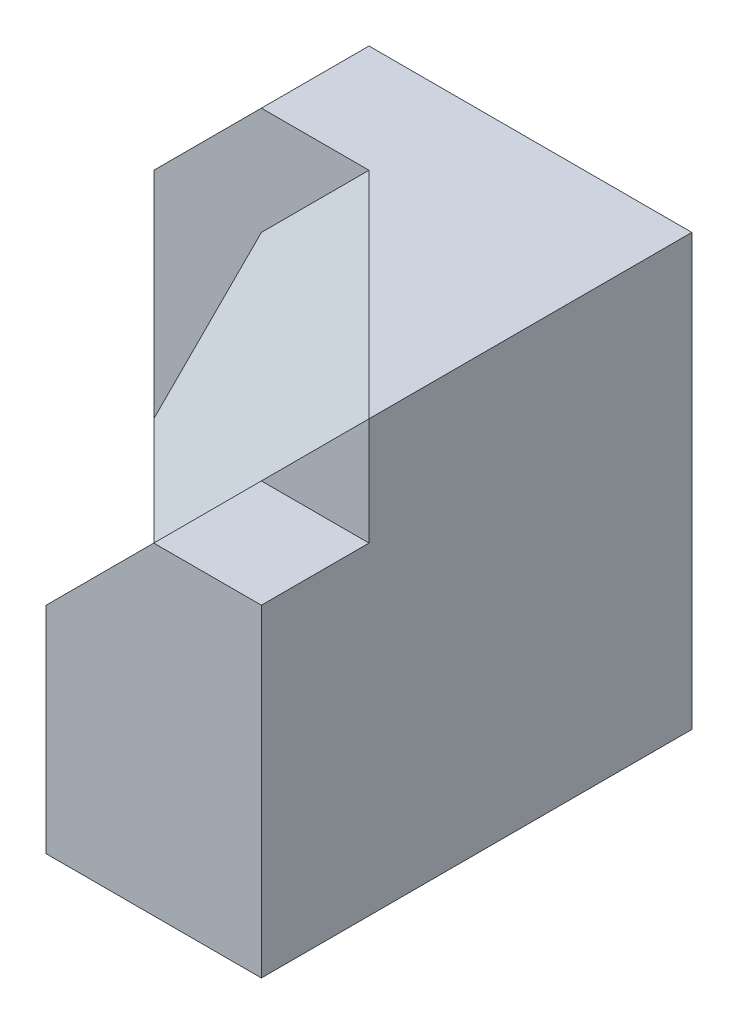
ISO-10303-21;
HEADER;
FILE_DESCRIPTION(('STEP AP214'),'2;1');
FILE_NAME('part.step','',(''),(''),'','','');
FILE_SCHEMA(('AUTOMOTIVE_DESIGN { 1 0 10303 214 1 1 1 1 }'));
ENDSEC;
DATA;
#1=APPLICATION_CONTEXT('core data for automotive mechanical design processes');
#2=APPLICATION_PROTOCOL_DEFINITION('international standard','automotive_design',2000,#1);
#3=PRODUCT_CONTEXT('',#1,'mechanical');
#4=PRODUCT('Part','Part','',(#3));
#5=PRODUCT_RELATED_PRODUCT_CATEGORY('part','',(#4));
#6=PRODUCT_DEFINITION_FORMATION('','',#4);
#7=PRODUCT_DEFINITION_CONTEXT('part definition',#1,'design');
#8=PRODUCT_DEFINITION('design','',#6,#7);
#9=PRODUCT_DEFINITION_SHAPE('','',#8);
#10=(LENGTH_UNIT() NAMED_UNIT(*) SI_UNIT(.MILLI.,.METRE.));
#11=(NAMED_UNIT(*) PLANE_ANGLE_UNIT() SI_UNIT($,.RADIAN.));
#12=(NAMED_UNIT(*) SI_UNIT($,.STERADIAN.) SOLID_ANGLE_UNIT());
#13=UNCERTAINTY_MEASURE_WITH_UNIT(LENGTH_MEASURE(1.E-05),#10,'distance_accuracy_value','');
#14=(GEOMETRIC_REPRESENTATION_CONTEXT(3) GLOBAL_UNCERTAINTY_ASSIGNED_CONTEXT((#13)) GLOBAL_UNIT_ASSIGNED_CONTEXT((#10,
#11,#12)) REPRESENTATION_CONTEXT('',''));
#15=CARTESIAN_POINT('',(0.,0.,0.));
#16=DIRECTION('',(0.,0.,1.));
#17=DIRECTION('',(1.,0.,0.));
#18=AXIS2_PLACEMENT_3D('',#15,#16,#17);
#19=CARTESIAN_POINT('',(-28.6563876651982,0.,-8.90969162995595));
#20=DIRECTION('',(0.707106781186547,0.,-0.707106781186548));
#21=DIRECTION('',(-0.707106781186548,0.,-0.707106781186547));
#22=AXIS2_PLACEMENT_3D('',#19,#20,#21);
#23=PLANE('',#22);
#24=DIRECTION('',(0.707106781186547,0.,0.707106781186548));
#25=VECTOR('',#24,1.);
#26=CARTESIAN_POINT('',(-18.6563876651982,10.,1.09030837004405));
#27=LINE('',#26,#25);
#28=CARTESIAN_POINT('',(-23.6563876651982,10.,-3.90969162995595));
#29=VERTEX_POINT('',#28);
#30=CARTESIAN_POINT('',(-18.6563876651982,10.,1.09030837004405));
#31=VERTEX_POINT('',#30);
#32=EDGE_CURVE('E58',#29,#31,#27,.T.);
#33=ORIENTED_EDGE('',*,*,#32,.F.);
#34=DIRECTION('',(0.,-1.,0.));
#35=VECTOR('',#34,1.);
#36=CARTESIAN_POINT('',(-23.6563876651982,20.,-3.90969162995595));
#37=LINE('',#36,#35);
#38=CARTESIAN_POINT('',(-23.6563876651982,5.,-3.90969162995595));
#39=VERTEX_POINT('',#38);
#40=EDGE_CURVE('E226',#29,#39,#37,.T.);
#41=ORIENTED_EDGE('',*,*,#40,.T.);
#42=DIRECTION('',(-0.707106781186548,0.,-0.707106781186547));
#43=VECTOR('',#42,1.);
#44=CARTESIAN_POINT('',(-28.6563876651982,5.,-8.90969162995595));
#45=LINE('',#44,#43);
#46=CARTESIAN_POINT('',(-28.6563876651982,5.,-8.90969162995595));
#47=VERTEX_POINT('',#46);
#48=EDGE_CURVE('E275',#39,#47,#45,.T.);
#49=ORIENTED_EDGE('',*,*,#48,.T.);
#50=DIRECTION('',(0.,1.,0.));
#51=VECTOR('',#50,1.);
#52=CARTESIAN_POINT('',(-28.6563876651982,0.,-8.90969162995595));
#53=LINE('',#52,#51);
#54=CARTESIAN_POINT('',(-28.6563876651982,0.,-8.90969162995595));
#55=VERTEX_POINT('',#54);
#56=EDGE_CURVE('E272',#55,#47,#53,.T.);
#57=ORIENTED_EDGE('',*,*,#56,.F.);
#58=DIRECTION('',(-0.707106781186548,0.,-0.707106781186547));
#59=VECTOR('',#58,1.);
#60=CARTESIAN_POINT('',(-28.6563876651982,0.,-8.90969162995595));
#61=LINE('',#60,#59);
#62=CARTESIAN_POINT('',(-18.6563876651982,0.,1.09030837004405));
#63=VERTEX_POINT('',#62);
#64=EDGE_CURVE('E235',#63,#55,#61,.T.);
#65=ORIENTED_EDGE('',*,*,#64,.F.);
#66=DIRECTION('',(0.,-1.,0.));
#67=VECTOR('',#66,1.);
#68=CARTESIAN_POINT('',(-18.6563876651982,20.,1.09030837004405));
#69=LINE('',#68,#67);
#70=EDGE_CURVE('E205',#31,#63,#69,.T.);
#71=ORIENTED_EDGE('',*,*,#70,.F.);
#72=EDGE_LOOP('',(#33,#41,#49,#57,#65,#71));
#73=FACE_BOUND('',#72,.T.);
#74=ADVANCED_FACE('F34',(#73),#23,.F.);
#75=CARTESIAN_POINT('',(-23.6563876651982,20.,-3.90969162995595));
#76=DIRECTION('',(-1.,0.,0.));
#77=DIRECTION('',(0.,0.,1.));
#78=AXIS2_PLACEMENT_3D('',#75,#76,#77);
#79=PLANE('',#78);
#80=ORIENTED_EDGE('',*,*,#40,.F.);
#81=DIRECTION('',(0.,-0.707106781186547,0.707106781186548));
#82=VECTOR('',#81,1.);
#83=CARTESIAN_POINT('',(-23.6563876651982,10.,-3.90969162995595));
#84=LINE('',#83,#82);
#85=CARTESIAN_POINT('',(-23.6563876651982,15.,-8.90969162995595));
#86=VERTEX_POINT('',#85);
#87=EDGE_CURVE('E179',#86,#29,#84,.T.);
#88=ORIENTED_EDGE('',*,*,#87,.F.);
#89=DIRECTION('',(0.,-1.,0.));
#90=VECTOR('',#89,1.);
#91=CARTESIAN_POINT('',(-23.6563876651982,20.,-8.90969162995595));
#92=LINE('',#91,#90);
#93=CARTESIAN_POINT('',(-23.6563876651982,5.,-8.90969162995595));
#94=VERTEX_POINT('',#93);
#95=EDGE_CURVE('E227',#86,#94,#92,.T.);
#96=ORIENTED_EDGE('',*,*,#95,.T.);
#97=DIRECTION('',(0.,0.,-1.));
#98=VECTOR('',#97,1.);
#99=CARTESIAN_POINT('',(-23.6563876651982,5.,-3.90969162995595));
#100=LINE('',#99,#98);
#101=EDGE_CURVE('E261',#39,#94,#100,.T.);
#102=ORIENTED_EDGE('',*,*,#101,.F.);
#103=EDGE_LOOP('',(#80,#88,#96,#102));
#104=FACE_BOUND('',#103,.T.);
#105=ADVANCED_FACE('F301',(#104),#79,.T.);
#106=CARTESIAN_POINT('',(-18.6563876651982,20.,1.09030837004405));
#107=DIRECTION('',(0.,0.,1.));
#108=DIRECTION('',(1.,0.,0.));
#109=AXIS2_PLACEMENT_3D('',#106,#107,#108);
#110=PLANE('',#109);
#111=DIRECTION('',(-1.,0.,0.));
#112=VECTOR('',#111,1.);
#113=CARTESIAN_POINT('',(-8.65638766519824,15.,1.09030837004405));
#114=LINE('',#113,#112);
#115=CARTESIAN_POINT('',(-8.65638766519824,15.,1.09030837004405));
#116=VERTEX_POINT('',#115);
#117=CARTESIAN_POINT('',(-13.6563876651982,15.,1.09030837004405));
#118=VERTEX_POINT('',#117);
#119=EDGE_CURVE('E51',#116,#118,#114,.T.);
#120=ORIENTED_EDGE('',*,*,#119,.F.);
#121=DIRECTION('',(0.,-1.,0.));
#122=VECTOR('',#121,1.);
#123=CARTESIAN_POINT('',(-8.65638766519824,20.,1.09030837004405));
#124=LINE('',#123,#122);
#125=CARTESIAN_POINT('',(-8.65638766519824,20.,1.09030837004405));
#126=VERTEX_POINT('',#125);
#127=EDGE_CURVE('E12',#126,#116,#124,.T.);
#128=ORIENTED_EDGE('',*,*,#127,.F.);
#129=DIRECTION('',(0.707106781186548,0.707106781186547,0.));
#130=VECTOR('',#129,1.);
#131=CARTESIAN_POINT('',(-8.65638766519824,20.,1.09030837004405));
#132=LINE('',#131,#130);
#133=EDGE_CURVE('E150',#118,#126,#132,.T.);
#134=ORIENTED_EDGE('',*,*,#133,.F.);
#135=EDGE_LOOP('',(#120,#128,#134));
#136=FACE_BOUND('',#135,.T.);
#137=ADVANCED_FACE('F306',(#136),#110,.T.);
#138=CARTESIAN_POINT('',(-18.6563876651982,20.,-8.90969162995595));
#139=DIRECTION('',(0.,0.,-1.));
#140=DIRECTION('',(-1.,0.,0.));
#141=AXIS2_PLACEMENT_3D('',#138,#139,#140);
#142=PLANE('',#141);
#143=DIRECTION('',(-1.,0.,0.));
#144=VECTOR('',#143,1.);
#145=CARTESIAN_POINT('',(-28.6563876651982,5.,-8.90969162995595));
#146=LINE('',#145,#144);
#147=EDGE_CURVE('E276',#94,#47,#146,.T.);
#148=ORIENTED_EDGE('',*,*,#147,.F.);
#149=ORIENTED_EDGE('',*,*,#95,.F.);
#150=DIRECTION('',(-0.707106781186548,-0.707106781186548,0.));
#151=VECTOR('',#150,1.);
#152=CARTESIAN_POINT('',(-18.6563876651982,20.,-8.90969162995595));
#153=LINE('',#152,#151);
#154=CARTESIAN_POINT('',(-18.6563876651982,20.,-8.90969162995595));
#155=VERTEX_POINT('',#154);
#156=EDGE_CURVE('E176',#155,#86,#153,.T.);
#157=ORIENTED_EDGE('',*,*,#156,.F.);
#158=DIRECTION('',(1.,0.,0.));
#159=VECTOR('',#158,1.);
#160=CARTESIAN_POINT('',(0.,20.,-8.90969162995594));
#161=LINE('',#160,#159);
#162=CARTESIAN_POINT('',(-23.6563876651982,20.,-8.90969162995595));
#163=VERTEX_POINT('',#162);
#164=EDGE_CURVE('E178',#163,#155,#161,.T.);
#165=ORIENTED_EDGE('',*,*,#164,.F.);
#166=DIRECTION('',(0.707106781186548,0.707106781186548,0.));
#167=VECTOR('',#166,1.);
#168=CARTESIAN_POINT('',(-23.6563876651982,20.,-8.90969162995595));
#169=LINE('',#168,#167);
#170=CARTESIAN_POINT('',(-28.6563876651982,15.,-8.90969162995595));
#171=VERTEX_POINT('',#170);
#172=EDGE_CURVE('E257',#171,#163,#169,.T.);
#173=ORIENTED_EDGE('',*,*,#172,.F.);
#174=DIRECTION('',(0.,1.,0.));
#175=VECTOR('',#174,1.);
#176=CARTESIAN_POINT('',(-28.6563876651982,0.,-8.90969162995595));
#177=LINE('',#176,#175);
#178=EDGE_CURVE('E214',#47,#171,#177,.T.);
#179=ORIENTED_EDGE('',*,*,#178,.F.);
#180=EDGE_LOOP('',(#148,#149,#157,#165,#173,#179));
#181=FACE_BOUND('',#180,.T.);
#182=ADVANCED_FACE('F36',(#181),#142,.F.);
#183=CARTESIAN_POINT('',(-8.65638766519824,20.,-13.9096916299559));
#184=DIRECTION('',(-1.,0.,0.));
#185=DIRECTION('',(0.,0.,1.));
#186=AXIS2_PLACEMENT_3D('',#183,#184,#185);
#187=PLANE('',#186);
#188=DIRECTION('',(0.,0.,-1.));
#189=VECTOR('',#188,1.);
#190=CARTESIAN_POINT('',(-8.65638766519824,0.,-13.9096916299559));
#191=LINE('',#190,#189);
#192=CARTESIAN_POINT('',(-8.65638766519824,0.,6.09030837004405));
#193=VERTEX_POINT('',#192);
#194=CARTESIAN_POINT('',(-8.65638766519824,0.,-13.9096916299559));
#195=VERTEX_POINT('',#194);
#196=EDGE_CURVE('E208',#193,#195,#191,.T.);
#197=ORIENTED_EDGE('',*,*,#196,.T.);
#198=DIRECTION('',(0.,-1.,0.));
#199=VECTOR('',#198,1.);
#200=CARTESIAN_POINT('',(-8.65638766519824,20.,-13.9096916299559));
#201=LINE('',#200,#199);
#202=CARTESIAN_POINT('',(-8.65638766519824,20.,-13.9096916299559));
#203=VERTEX_POINT('',#202);
#204=EDGE_CURVE('E43',#203,#195,#201,.T.);
#205=ORIENTED_EDGE('',*,*,#204,.F.);
#206=DIRECTION('',(0.,0.,-1.));
#207=VECTOR('',#206,1.);
#208=CARTESIAN_POINT('',(-8.65638766519824,20.,-13.9096916299559));
#209=LINE('',#208,#207);
#210=EDGE_CURVE('E216',#126,#203,#209,.T.);
#211=ORIENTED_EDGE('',*,*,#210,.F.);
#212=ORIENTED_EDGE('',*,*,#127,.T.);
#213=DIRECTION('',(0.,0.,-1.));
#214=VECTOR('',#213,1.);
#215=CARTESIAN_POINT('',(-8.65638766519824,15.,6.09030837004405));
#216=LINE('',#215,#214);
#217=CARTESIAN_POINT('',(-8.65638766519824,15.,6.09030837004405));
#218=VERTEX_POINT('',#217);
#219=EDGE_CURVE('E130',#218,#116,#216,.T.);
#220=ORIENTED_EDGE('',*,*,#219,.F.);
#221=DIRECTION('',(0.,1.,0.));
#222=VECTOR('',#221,1.);
#223=CARTESIAN_POINT('',(-8.65638766519824,0.,6.09030837004405));
#224=LINE('',#223,#222);
#225=EDGE_CURVE('E136',#193,#218,#224,.T.);
#226=ORIENTED_EDGE('',*,*,#225,.F.);
#227=EDGE_LOOP('',(#197,#205,#211,#212,#220,#226));
#228=FACE_BOUND('',#227,.T.);
#229=ADVANCED_FACE('F145',(#228),#187,.F.);
#230=CARTESIAN_POINT('',(-23.6563876651982,20.,-13.9096916299559));
#231=DIRECTION('',(0.,0.,1.));
#232=DIRECTION('',(1.,0.,0.));
#233=AXIS2_PLACEMENT_3D('',#230,#231,#232);
#234=PLANE('',#233);
#235=DIRECTION('',(0.,-1.,0.));
#236=VECTOR('',#235,1.);
#237=CARTESIAN_POINT('',(-28.6563876651982,0.,-13.9096916299559));
#238=LINE('',#237,#236);
#239=CARTESIAN_POINT('',(-28.6563876651982,15.,-13.9096916299559));
#240=VERTEX_POINT('',#239);
#241=CARTESIAN_POINT('',(-28.6563876651982,0.,-13.9096916299559));
#242=VERTEX_POINT('',#241);
#243=EDGE_CURVE('E252',#240,#242,#238,.T.);
#244=ORIENTED_EDGE('',*,*,#243,.F.);
#245=DIRECTION('',(0.707106781186548,0.707106781186548,0.));
#246=VECTOR('',#245,1.);
#247=CARTESIAN_POINT('',(-23.6563876651982,20.,-13.909691629956));
#248=LINE('',#247,#246);
#249=CARTESIAN_POINT('',(-23.6563876651982,20.,-13.909691629956));
#250=VERTEX_POINT('',#249);
#251=EDGE_CURVE('E251',#240,#250,#248,.T.);
#252=ORIENTED_EDGE('',*,*,#251,.T.);
#253=DIRECTION('',(-1.,0.,0.));
#254=VECTOR('',#253,1.);
#255=CARTESIAN_POINT('',(-23.6563876651982,20.,-13.9096916299559));
#256=LINE('',#255,#254);
#257=EDGE_CURVE('E221',#203,#250,#256,.T.);
#258=ORIENTED_EDGE('',*,*,#257,.F.);
#259=ORIENTED_EDGE('',*,*,#204,.T.);
#260=DIRECTION('',(-1.,0.,0.));
#261=VECTOR('',#260,1.);
#262=CARTESIAN_POINT('',(-23.6563876651982,0.,-13.9096916299559));
#263=LINE('',#262,#261);
#264=EDGE_CURVE('E211',#195,#242,#263,.T.);
#265=ORIENTED_EDGE('',*,*,#264,.T.);
#266=EDGE_LOOP('',(#244,#252,#258,#259,#265));
#267=FACE_BOUND('',#266,.T.);
#268=ADVANCED_FACE('F250',(#267),#234,.F.);
#269=CARTESIAN_POINT('',(0.,20.,0.));
#270=DIRECTION('',(0.,-1.,0.));
#271=DIRECTION('',(0.,0.,-1.));
#272=AXIS2_PLACEMENT_3D('',#269,#270,#271);
#273=PLANE('',#272);
#274=ORIENTED_EDGE('',*,*,#164,.T.);
#275=DIRECTION('',(-0.707106781186547,0.,-0.707106781186548));
#276=VECTOR('',#275,1.);
#277=CARTESIAN_POINT('',(-8.65638766519824,20.,1.09030837004405));
#278=LINE('',#277,#276);
#279=EDGE_CURVE('E147',#126,#155,#278,.T.);
#280=ORIENTED_EDGE('',*,*,#279,.F.);
#281=ORIENTED_EDGE('',*,*,#210,.T.);
#282=ORIENTED_EDGE('',*,*,#257,.T.);
#283=DIRECTION('',(0.,0.,1.));
#284=VECTOR('',#283,1.);
#285=CARTESIAN_POINT('',(-23.6563876651982,20.,-13.909691629956));
#286=LINE('',#285,#284);
#287=EDGE_CURVE('E246',#250,#163,#286,.T.);
#288=ORIENTED_EDGE('',*,*,#287,.T.);
#289=EDGE_LOOP('',(#274,#280,#281,#282,#288));
#290=FACE_BOUND('',#289,.T.);
#291=ADVANCED_FACE('F245',(#290),#273,.F.);
#292=CARTESIAN_POINT('',(0.,0.,0.));
#293=DIRECTION('',(0.,-1.,0.));
#294=DIRECTION('',(0.,0.,-1.));
#295=AXIS2_PLACEMENT_3D('',#292,#293,#294);
#296=PLANE('',#295);
#297=ORIENTED_EDGE('',*,*,#196,.F.);
#298=DIRECTION('',(1.,0.,0.));
#299=VECTOR('',#298,1.);
#300=CARTESIAN_POINT('',(-18.6563876651982,0.,6.09030837004405));
#301=LINE('',#300,#299);
#302=CARTESIAN_POINT('',(-18.6563876651982,0.,6.09030837004405));
#303=VERTEX_POINT('',#302);
#304=EDGE_CURVE('E142',#303,#193,#301,.T.);
#305=ORIENTED_EDGE('',*,*,#304,.F.);
#306=DIRECTION('',(0.,0.,-1.));
#307=VECTOR('',#306,1.);
#308=CARTESIAN_POINT('',(-18.6563876651982,0.,6.09030837004405));
#309=LINE('',#308,#307);
#310=EDGE_CURVE('E159',#303,#63,#309,.T.);
#311=ORIENTED_EDGE('',*,*,#310,.T.);
#312=ORIENTED_EDGE('',*,*,#64,.T.);
#313=DIRECTION('',(0.,0.,1.));
#314=VECTOR('',#313,1.);
#315=CARTESIAN_POINT('',(-28.6563876651982,0.,-13.9096916299559));
#316=LINE('',#315,#314);
#317=EDGE_CURVE('E218',#242,#55,#316,.T.);
#318=ORIENTED_EDGE('',*,*,#317,.F.);
#319=ORIENTED_EDGE('',*,*,#264,.F.);
#320=EDGE_LOOP('',(#297,#305,#311,#312,#318,#319));
#321=FACE_BOUND('',#320,.T.);
#322=ADVANCED_FACE('F206',(#321),#296,.T.);
#323=CARTESIAN_POINT('',(-28.6563876651982,0.,0.));
#324=DIRECTION('',(1.,0.,0.));
#325=DIRECTION('',(0.,0.,-1.));
#326=AXIS2_PLACEMENT_3D('',#323,#324,#325);
#327=PLANE('',#326);
#328=ORIENTED_EDGE('',*,*,#317,.T.);
#329=ORIENTED_EDGE('',*,*,#56,.T.);
#330=ORIENTED_EDGE('',*,*,#178,.T.);
#331=DIRECTION('',(0.,0.,1.));
#332=VECTOR('',#331,1.);
#333=CARTESIAN_POINT('',(-28.6563876651982,15.,-13.909691629956));
#334=LINE('',#333,#332);
#335=EDGE_CURVE('E256',#240,#171,#334,.T.);
#336=ORIENTED_EDGE('',*,*,#335,.F.);
#337=ORIENTED_EDGE('',*,*,#243,.T.);
#338=EDGE_LOOP('',(#328,#329,#330,#336,#337));
#339=FACE_BOUND('',#338,.T.);
#340=ADVANCED_FACE('F271',(#339),#327,.F.);
#341=CARTESIAN_POINT('',(-23.6563876651982,20.,-13.909691629956));
#342=DIRECTION('',(0.707106781186548,-0.707106781186548,0.));
#343=DIRECTION('',(0.707106781186548,0.707106781186548,0.));
#344=AXIS2_PLACEMENT_3D('',#341,#342,#343);
#345=PLANE('',#344);
#346=ORIENTED_EDGE('',*,*,#172,.T.);
#347=ORIENTED_EDGE('',*,*,#287,.F.);
#348=ORIENTED_EDGE('',*,*,#251,.F.);
#349=ORIENTED_EDGE('',*,*,#335,.T.);
#350=EDGE_LOOP('',(#346,#347,#348,#349));
#351=FACE_BOUND('',#350,.T.);
#352=ADVANCED_FACE('F290',(#351),#345,.F.);
#353=CARTESIAN_POINT('',(-28.6563876651982,5.,-3.90969162995595));
#354=DIRECTION('',(0.,-1.,0.));
#355=DIRECTION('',(0.,0.,-1.));
#356=AXIS2_PLACEMENT_3D('',#353,#354,#355);
#357=PLANE('',#356);
#358=ORIENTED_EDGE('',*,*,#147,.T.);
#359=ORIENTED_EDGE('',*,*,#48,.F.);
#360=ORIENTED_EDGE('',*,*,#101,.T.);
#361=EDGE_LOOP('',(#358,#359,#360));
#362=FACE_BOUND('',#361,.T.);
#363=ADVANCED_FACE('F284',(#362),#357,.F.);
#364=CARTESIAN_POINT('',(-9.91556534508076,9.91556534508076,9.91556534508078));
#365=DIRECTION('',(-0.577350269189625,0.577350269189626,0.577350269189627));
#366=DIRECTION('',(0.,-0.707106781186548,0.707106781186547));
#367=AXIS2_PLACEMENT_3D('',#364,#365,#366);
#368=PLANE('',#367);
#369=ORIENTED_EDGE('',*,*,#279,.T.);
#370=ORIENTED_EDGE('',*,*,#156,.T.);
#371=ORIENTED_EDGE('',*,*,#87,.T.);
#372=ORIENTED_EDGE('',*,*,#32,.T.);
#373=EDGE_CURVE('E186',#31,#118,#132,.T.);
#374=ORIENTED_EDGE('',*,*,#373,.T.);
#375=ORIENTED_EDGE('',*,*,#133,.T.);
#376=EDGE_LOOP('',(#369,#370,#371,#372,#374,#375));
#377=FACE_BOUND('',#376,.T.);
#378=ADVANCED_FACE('F297',(#377),#368,.T.);
#379=CARTESIAN_POINT('',(-8.65638766519824,15.,6.09030837004405));
#380=DIRECTION('',(0.,-1.,0.));
#381=DIRECTION('',(0.,0.,-1.));
#382=AXIS2_PLACEMENT_3D('',#379,#380,#381);
#383=PLANE('',#382);
#384=ORIENTED_EDGE('',*,*,#119,.T.);
#385=DIRECTION('',(0.,0.,-1.));
#386=VECTOR('',#385,1.);
#387=CARTESIAN_POINT('',(-13.6563876651982,15.,6.09030837004405));
#388=LINE('',#387,#386);
#389=CARTESIAN_POINT('',(-13.6563876651982,15.,6.09030837004405));
#390=VERTEX_POINT('',#389);
#391=EDGE_CURVE('E132',#390,#118,#388,.T.);
#392=ORIENTED_EDGE('',*,*,#391,.F.);
#393=DIRECTION('',(-1.,0.,0.));
#394=VECTOR('',#393,1.);
#395=CARTESIAN_POINT('',(-8.65638766519824,15.,6.09030837004405));
#396=LINE('',#395,#394);
#397=EDGE_CURVE('E126',#218,#390,#396,.T.);
#398=ORIENTED_EDGE('',*,*,#397,.F.);
#399=ORIENTED_EDGE('',*,*,#219,.T.);
#400=EDGE_LOOP('',(#384,#392,#398,#399));
#401=FACE_BOUND('',#400,.T.);
#402=ADVANCED_FACE('F128',(#401),#383,.F.);
#403=CARTESIAN_POINT('',(-13.6563876651982,15.,6.09030837004405));
#404=DIRECTION('',(0.707106781186547,-0.707106781186548,0.));
#405=DIRECTION('',(0.707106781186548,0.707106781186547,0.));
#406=AXIS2_PLACEMENT_3D('',#403,#404,#405);
#407=PLANE('',#406);
#408=ORIENTED_EDGE('',*,*,#373,.F.);
#409=DIRECTION('',(0.,0.,-1.));
#410=VECTOR('',#409,1.);
#411=CARTESIAN_POINT('',(-18.6563876651982,10.,6.09030837004405));
#412=LINE('',#411,#410);
#413=CARTESIAN_POINT('',(-18.6563876651982,10.,6.09030837004405));
#414=VERTEX_POINT('',#413);
#415=EDGE_CURVE('E152',#414,#31,#412,.T.);
#416=ORIENTED_EDGE('',*,*,#415,.F.);
#417=DIRECTION('',(-0.707106781186548,-0.707106781186547,0.));
#418=VECTOR('',#417,1.);
#419=CARTESIAN_POINT('',(-13.6563876651982,15.,6.09030837004405));
#420=LINE('',#419,#418);
#421=EDGE_CURVE('E135',#390,#414,#420,.T.);
#422=ORIENTED_EDGE('',*,*,#421,.F.);
#423=ORIENTED_EDGE('',*,*,#391,.T.);
#424=EDGE_LOOP('',(#408,#416,#422,#423));
#425=FACE_BOUND('',#424,.T.);
#426=ADVANCED_FACE('F201',(#425),#407,.F.);
#427=CARTESIAN_POINT('',(-18.6563876651982,10.,6.09030837004405));
#428=DIRECTION('',(1.,0.,0.));
#429=DIRECTION('',(0.,0.,-1.));
#430=AXIS2_PLACEMENT_3D('',#427,#428,#429);
#431=PLANE('',#430);
#432=ORIENTED_EDGE('',*,*,#70,.T.);
#433=ORIENTED_EDGE('',*,*,#310,.F.);
#434=DIRECTION('',(0.,-1.,0.));
#435=VECTOR('',#434,1.);
#436=CARTESIAN_POINT('',(-18.6563876651982,10.,6.09030837004405));
#437=LINE('',#436,#435);
#438=EDGE_CURVE('E169',#414,#303,#437,.T.);
#439=ORIENTED_EDGE('',*,*,#438,.F.);
#440=ORIENTED_EDGE('',*,*,#415,.T.);
#441=EDGE_LOOP('',(#432,#433,#439,#440));
#442=FACE_BOUND('',#441,.T.);
#443=ADVANCED_FACE('F204',(#442),#431,.F.);
#444=CARTESIAN_POINT('',(0.,0.,6.09030837004405));
#445=DIRECTION('',(0.,0.,1.));
#446=DIRECTION('',(1.,0.,0.));
#447=AXIS2_PLACEMENT_3D('',#444,#445,#446);
#448=PLANE('',#447);
#449=ORIENTED_EDGE('',*,*,#225,.T.);
#450=ORIENTED_EDGE('',*,*,#397,.T.);
#451=ORIENTED_EDGE('',*,*,#421,.T.);
#452=ORIENTED_EDGE('',*,*,#438,.T.);
#453=ORIENTED_EDGE('',*,*,#304,.T.);
#454=EDGE_LOOP('',(#449,#450,#451,#452,#453));
#455=FACE_BOUND('',#454,.T.);
#456=ADVANCED_FACE('F140',(#455),#448,.T.);
#457=CLOSED_SHELL('',(#74,#105,#137,#182,#229,#268,#291,#322,#340,#352,#363,#378,#402,#426,#443,#456));
#458=MANIFOLD_SOLID_BREP('B2',#457);
#459=ADVANCED_BREP_SHAPE_REPRESENTATION('',(#18,#458),#14);
#460=SHAPE_DEFINITION_REPRESENTATION(#9,#459);
ENDSEC;
END-ISO-10303-21;
